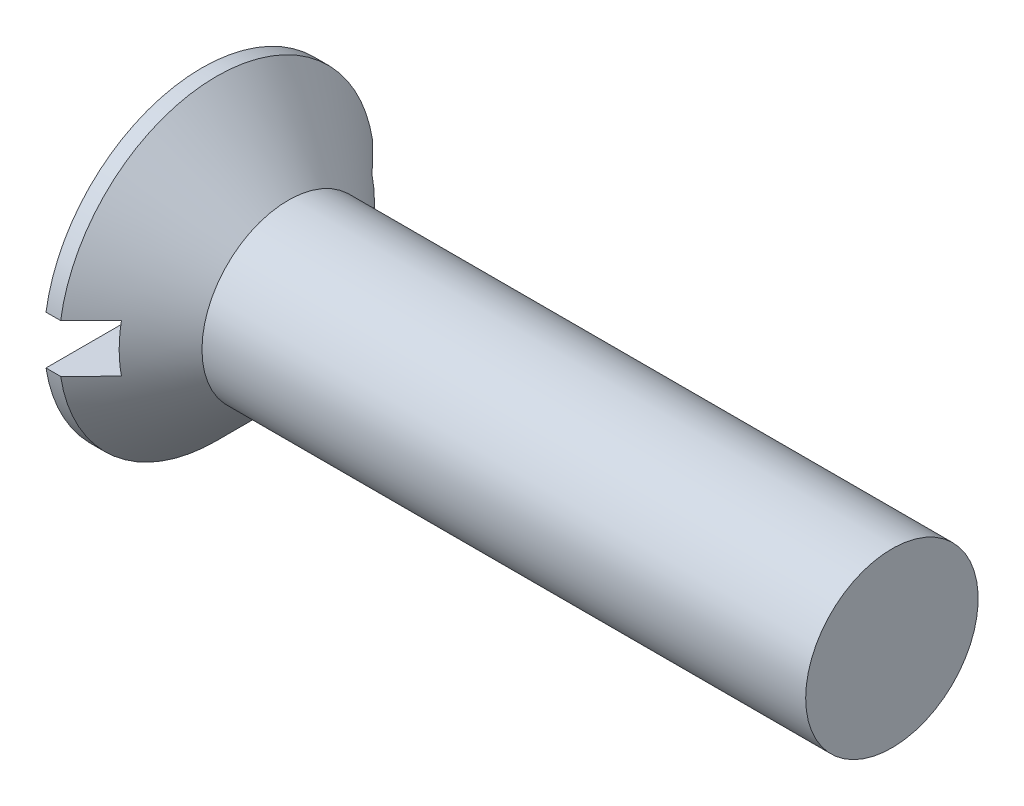
ISO-10303-21;
HEADER;
FILE_DESCRIPTION(('STEP AP214'),'2;1');
FILE_NAME('part.step','',(''),(''),'','','');
FILE_SCHEMA(('AUTOMOTIVE_DESIGN { 1 0 10303 214 1 1 1 1 }'));
ENDSEC;
DATA;
#1=APPLICATION_CONTEXT('core data for automotive mechanical design processes');
#2=APPLICATION_PROTOCOL_DEFINITION('international standard','automotive_design',2000,#1);
#3=PRODUCT_CONTEXT('',#1,'mechanical');
#4=PRODUCT('Part','Part','',(#3));
#5=PRODUCT_RELATED_PRODUCT_CATEGORY('part','',(#4));
#6=PRODUCT_DEFINITION_FORMATION('','',#4);
#7=PRODUCT_DEFINITION_CONTEXT('part definition',#1,'design');
#8=PRODUCT_DEFINITION('design','',#6,#7);
#9=PRODUCT_DEFINITION_SHAPE('','',#8);
#10=(LENGTH_UNIT() NAMED_UNIT(*) SI_UNIT(.MILLI.,.METRE.));
#11=(NAMED_UNIT(*) PLANE_ANGLE_UNIT() SI_UNIT($,.RADIAN.));
#12=(NAMED_UNIT(*) SI_UNIT($,.STERADIAN.) SOLID_ANGLE_UNIT());
#13=UNCERTAINTY_MEASURE_WITH_UNIT(LENGTH_MEASURE(1.E-05),#10,'distance_accuracy_value','');
#14=(GEOMETRIC_REPRESENTATION_CONTEXT(3) GLOBAL_UNCERTAINTY_ASSIGNED_CONTEXT((#13)) GLOBAL_UNIT_ASSIGNED_CONTEXT((#10,
#11,#12)) REPRESENTATION_CONTEXT('',''));
#15=CARTESIAN_POINT('',(0.,0.,0.));
#16=DIRECTION('',(0.,0.,1.));
#17=DIRECTION('',(1.,0.,0.));
#18=AXIS2_PLACEMENT_3D('',#15,#16,#17);
#19=CARTESIAN_POINT('',(2.6,-1.4,-9.15));
#20=DIRECTION('',(1.,0.,0.));
#21=DIRECTION('',(0.,0.,-1.));
#22=AXIS2_PLACEMENT_3D('',#19,#20,#21);
#23=PLANE('',#22);
#24=DIRECTION('',(0.,0.,1.));
#25=VECTOR('',#24,1.);
#26=CARTESIAN_POINT('',(2.6,-0.774782608695622,-9.15));
#27=LINE('',#26,#25);
#28=CARTESIAN_POINT('',(2.6,-0.774782608695655,0.774782608695653));
#29=VERTEX_POINT('',#28);
#30=CARTESIAN_POINT('',(2.6,-0.774782608695663,3.00739130434782));
#31=VERTEX_POINT('',#30);
#32=EDGE_CURVE('E165',#29,#31,#27,.T.);
#33=ORIENTED_EDGE('',*,*,#32,.F.);
#34=DIRECTION('',(0.,1.,0.));
#35=VECTOR('',#34,1.);
#36=CARTESIAN_POINT('',(2.6,-1.4,0.774782608695655));
#37=LINE('',#36,#35);
#38=CARTESIAN_POINT('',(2.6,-1.4,0.774782608695655));
#39=VERTEX_POINT('',#38);
#40=EDGE_CURVE('E11',#39,#29,#37,.T.);
#41=ORIENTED_EDGE('',*,*,#40,.F.);
#42=DIRECTION('',(0.,0.,1.));
#43=VECTOR('',#42,1.);
#44=CARTESIAN_POINT('',(2.6,-1.4,-9.15));
#45=LINE('',#44,#43);
#46=CARTESIAN_POINT('',(2.6,-1.4,7.26636084983399));
#47=VERTEX_POINT('',#46);
#48=EDGE_CURVE('E231',#39,#47,#45,.T.);
#49=ORIENTED_EDGE('',*,*,#48,.T.);
#50=CARTESIAN_POINT('',(2.6,0.,0.));
#51=DIRECTION('',(1.,0.,0.));
#52=DIRECTION('',(0.,0.,-1.));
#53=AXIS2_PLACEMENT_3D('',#50,#51,#52);
#54=CIRCLE('',#53,7.40000000000001);
#55=CARTESIAN_POINT('',(2.6,1.4,7.26636084983399));
#56=VERTEX_POINT('',#55);
#57=EDGE_CURVE('E267',#47,#56,#54,.F.);
#58=ORIENTED_EDGE('',*,*,#57,.T.);
#59=DIRECTION('',(0.,0.,-1.));
#60=VECTOR('',#59,1.);
#61=CARTESIAN_POINT('',(2.6,1.4,9.15));
#62=LINE('',#61,#60);
#63=CARTESIAN_POINT('',(2.6,1.4,0.774782608695654));
#64=VERTEX_POINT('',#63);
#65=EDGE_CURVE('E228',#56,#64,#62,.T.);
#66=ORIENTED_EDGE('',*,*,#65,.T.);
#67=CARTESIAN_POINT('',(2.6,0.774782608695649,0.774782608695653));
#68=VERTEX_POINT('',#67);
#69=EDGE_CURVE('E42',#68,#64,#37,.T.);
#70=ORIENTED_EDGE('',*,*,#69,.F.);
#71=DIRECTION('',(0.,0.,-1.));
#72=VECTOR('',#71,1.);
#73=CARTESIAN_POINT('',(2.6,0.774782608695683,-9.14999999999999));
#74=LINE('',#73,#72);
#75=CARTESIAN_POINT('',(2.6,0.774782608695642,3.00739130434783));
#76=VERTEX_POINT('',#75);
#77=EDGE_CURVE('E373',#76,#68,#74,.T.);
#78=ORIENTED_EDGE('',*,*,#77,.F.);
#79=DIRECTION('',(0.,1.,0.));
#80=VECTOR('',#79,1.);
#81=CARTESIAN_POINT('',(2.6,-1.40000000000004,3.00739130434782));
#82=LINE('',#81,#80);
#83=EDGE_CURVE('E317',#31,#76,#82,.T.);
#84=ORIENTED_EDGE('',*,*,#83,.F.);
#85=EDGE_LOOP('',(#33,#41,#49,#58,#66,#70,#78,#84));
#86=FACE_BOUND('',#85,.T.);
#87=ADVANCED_FACE('F34',(#86),#23,.F.);
#88=DIRECTION('',(0.,0.,1.));
#89=VECTOR('',#88,1.);
#90=CARTESIAN_POINT('',(2.6,-0.774782608695622,-9.15));
#91=LINE('',#90,#89);
#92=CARTESIAN_POINT('',(2.6,-0.774782608695642,-3.00739130434783));
#93=VERTEX_POINT('',#92);
#94=CARTESIAN_POINT('',(2.6,-0.77478260869565,-0.774782608695652));
#95=VERTEX_POINT('',#94);
#96=EDGE_CURVE('E190',#93,#95,#91,.T.);
#97=ORIENTED_EDGE('',*,*,#96,.F.);
#98=DIRECTION('',(0.,-1.,0.));
#99=VECTOR('',#98,1.);
#100=CARTESIAN_POINT('',(2.6,-1.40000000000002,-3.00739130434783));
#101=LINE('',#100,#99);
#102=CARTESIAN_POINT('',(2.6,0.774782608695662,-3.00739130434782));
#103=VERTEX_POINT('',#102);
#104=EDGE_CURVE('E367',#103,#93,#101,.T.);
#105=ORIENTED_EDGE('',*,*,#104,.F.);
#106=DIRECTION('',(0.,0.,-1.));
#107=VECTOR('',#106,1.);
#108=CARTESIAN_POINT('',(2.6,0.774782608695683,-9.14999999999999));
#109=LINE('',#108,#107);
#110=CARTESIAN_POINT('',(2.6,0.774782608695654,-0.774782608695652));
#111=VERTEX_POINT('',#110);
#112=EDGE_CURVE('E378',#111,#103,#109,.T.);
#113=ORIENTED_EDGE('',*,*,#112,.F.);
#114=DIRECTION('',(0.,-1.,0.));
#115=VECTOR('',#114,1.);
#116=CARTESIAN_POINT('',(2.6,-1.4,-0.774782608695653));
#117=LINE('',#116,#115);
#118=CARTESIAN_POINT('',(2.6,1.4,-0.774782608695653));
#119=VERTEX_POINT('',#118);
#120=EDGE_CURVE('E348',#119,#111,#117,.T.);
#121=ORIENTED_EDGE('',*,*,#120,.F.);
#122=CARTESIAN_POINT('',(2.6,1.4,-7.26636084983399));
#123=VERTEX_POINT('',#122);
#124=EDGE_CURVE('E56',#119,#123,#62,.T.);
#125=ORIENTED_EDGE('',*,*,#124,.T.);
#126=CARTESIAN_POINT('',(2.6,-1.4,-7.26636084983399));
#127=VERTEX_POINT('',#126);
#128=EDGE_CURVE('E264',#123,#127,#54,.F.);
#129=ORIENTED_EDGE('',*,*,#128,.T.);
#130=CARTESIAN_POINT('',(2.6,-1.4,-0.774782608695653));
#131=VERTEX_POINT('',#130);
#132=EDGE_CURVE('E232',#127,#131,#45,.T.);
#133=ORIENTED_EDGE('',*,*,#132,.T.);
#134=EDGE_CURVE('E347',#95,#131,#117,.T.);
#135=ORIENTED_EDGE('',*,*,#134,.F.);
#136=EDGE_LOOP('',(#97,#105,#113,#121,#125,#129,#133,#135));
#137=FACE_BOUND('',#136,.T.);
#138=ADVANCED_FACE('F310',(#137),#23,.F.);
#139=CARTESIAN_POINT('',(6.6459392575928,0.,0.439876265466817));
#140=DIRECTION('',(-0.0824937845566324,0.,-0.996591579088206));
#141=DIRECTION('',(-0.996591579088206,0.,0.0824937845566324));
#142=AXIS2_PLACEMENT_3D('',#139,#140,#141);
#143=PLANE('',#142);
#144=ORIENTED_EDGE('',*,*,#40,.T.);
#145=DIRECTION('',(0.993217774269884,0.0822145147597983,-0.0822145147597981));
#146=VECTOR('',#145,1.);
#147=CARTESIAN_POINT('',(6.68185819745171,-0.436903042184183,0.436903042184182));
#148=LINE('',#147,#146);
#149=CARTESIAN_POINT('',(5.98,-0.495000000000002,0.494999999999998));
#150=VERTEX_POINT('',#149);
#151=EDGE_CURVE('E163',#29,#150,#148,.T.);
#152=ORIENTED_EDGE('',*,*,#151,.T.);
#153=DIRECTION('',(0.800804244667336,0.595246633368948,-0.0662873078779819));
#154=VECTOR('',#153,1.);
#155=CARTESIAN_POINT('',(0.,-4.94,0.990000000000001));
#156=LINE('',#155,#154);
#157=CARTESIAN_POINT('',(0.,-4.94,0.990000000000001));
#158=VERTEX_POINT('',#157);
#159=EDGE_CURVE('E187',#158,#150,#156,.T.);
#160=ORIENTED_EDGE('',*,*,#159,.F.);
#161=DIRECTION('',(0.,-1.,0.));
#162=VECTOR('',#161,1.);
#163=CARTESIAN_POINT('',(0.,4.94,0.989999999999999));
#164=LINE('',#163,#162);
#165=CARTESIAN_POINT('',(0.,-1.4,0.99));
#166=VERTEX_POINT('',#165);
#167=EDGE_CURVE('E324',#166,#158,#164,.T.);
#168=ORIENTED_EDGE('',*,*,#167,.F.);
#169=DIRECTION('',(0.996591579088206,0.,-0.0824937845566324));
#170=VECTOR('',#169,1.);
#171=CARTESIAN_POINT('',(3.4159422920296,-1.4,0.707242235024309));
#172=LINE('',#171,#170);
#173=EDGE_CURVE('E223',#166,#39,#172,.T.);
#174=ORIENTED_EDGE('',*,*,#173,.T.);
#175=EDGE_LOOP('',(#144,#152,#160,#168,#174));
#176=FACE_BOUND('',#175,.T.);
#177=ADVANCED_FACE('F185',(#176),#143,.T.);
#178=DIRECTION('',(0.800804244667336,-0.595246633368948,-0.0662873078779817));
#179=VECTOR('',#178,1.);
#180=CARTESIAN_POINT('',(0.,4.94,0.989999999999999));
#181=LINE('',#180,#179);
#182=CARTESIAN_POINT('',(0.,4.94,0.989999999999999));
#183=VERTEX_POINT('',#182);
#184=CARTESIAN_POINT('',(5.98,0.495,0.495));
#185=VERTEX_POINT('',#184);
#186=EDGE_CURVE('E210',#183,#185,#181,.T.);
#187=ORIENTED_EDGE('',*,*,#186,.T.);
#188=DIRECTION('',(-0.993217774269884,0.0822145147597977,0.082214514759798));
#189=VECTOR('',#188,1.);
#190=CARTESIAN_POINT('',(6.68185819745171,0.43690304218418,0.436903042184181));
#191=LINE('',#190,#189);
#192=EDGE_CURVE('E375',#185,#68,#191,.T.);
#193=ORIENTED_EDGE('',*,*,#192,.T.);
#194=ORIENTED_EDGE('',*,*,#69,.T.);
#195=DIRECTION('',(-0.996591579088206,0.,0.0824937845566324));
#196=VECTOR('',#195,1.);
#197=CARTESIAN_POINT('',(1.91145151043211,1.4,0.831777843200017));
#198=LINE('',#197,#196);
#199=CARTESIAN_POINT('',(0.,1.4,0.99));
#200=VERTEX_POINT('',#199);
#201=EDGE_CURVE('E225',#64,#200,#198,.T.);
#202=ORIENTED_EDGE('',*,*,#201,.T.);
#203=EDGE_CURVE('E325',#183,#200,#164,.T.);
#204=ORIENTED_EDGE('',*,*,#203,.F.);
#205=EDGE_LOOP('',(#187,#193,#194,#202,#204));
#206=FACE_BOUND('',#205,.T.);
#207=ADVANCED_FACE('F411',(#206),#143,.T.);
#208=CARTESIAN_POINT('',(6.6459392575928,0.,-0.439876265466817));
#209=DIRECTION('',(-0.0824937845566324,0.,0.996591579088206));
#210=DIRECTION('',(0.996591579088206,0.,0.0824937845566324));
#211=AXIS2_PLACEMENT_3D('',#208,#209,#210);
#212=PLANE('',#211);
#213=DIRECTION('',(0.800804244667336,0.595246633368948,0.0662873078779818));
#214=VECTOR('',#213,1.);
#215=CARTESIAN_POINT('',(0.,-4.94,-0.99));
#216=LINE('',#215,#214);
#217=CARTESIAN_POINT('',(0.,-4.94,-0.99));
#218=VERTEX_POINT('',#217);
#219=CARTESIAN_POINT('',(5.98,-0.495,-0.495));
#220=VERTEX_POINT('',#219);
#221=EDGE_CURVE('E205',#218,#220,#216,.T.);
#222=ORIENTED_EDGE('',*,*,#221,.T.);
#223=DIRECTION('',(-0.993217774269884,-0.0822145147597978,-0.082214514759798));
#224=VECTOR('',#223,1.);
#225=CARTESIAN_POINT('',(6.68185819745171,-0.43690304218418,-0.436903042184181));
#226=LINE('',#225,#224);
#227=EDGE_CURVE('E364',#220,#95,#226,.T.);
#228=ORIENTED_EDGE('',*,*,#227,.T.);
#229=ORIENTED_EDGE('',*,*,#134,.T.);
#230=DIRECTION('',(-0.996591579088206,0.,-0.0824937845566324));
#231=VECTOR('',#230,1.);
#232=CARTESIAN_POINT('',(1.91145151043211,-1.4,-0.831777843200017));
#233=LINE('',#232,#231);
#234=CARTESIAN_POINT('',(0.,-1.4,-0.99));
#235=VERTEX_POINT('',#234);
#236=EDGE_CURVE('E220',#131,#235,#233,.T.);
#237=ORIENTED_EDGE('',*,*,#236,.T.);
#238=DIRECTION('',(0.,1.,0.));
#239=VECTOR('',#238,1.);
#240=CARTESIAN_POINT('',(0.,-4.94,-0.99));
#241=LINE('',#240,#239);
#242=EDGE_CURVE('E208',#218,#235,#241,.T.);
#243=ORIENTED_EDGE('',*,*,#242,.F.);
#244=EDGE_LOOP('',(#222,#228,#229,#237,#243));
#245=FACE_BOUND('',#244,.T.);
#246=ADVANCED_FACE('F361',(#245),#212,.T.);
#247=ORIENTED_EDGE('',*,*,#120,.T.);
#248=DIRECTION('',(0.993217774269884,-0.0822145147597983,0.082214514759798));
#249=VECTOR('',#248,1.);
#250=CARTESIAN_POINT('',(6.68185819745171,0.436903042184183,-0.436903042184181));
#251=LINE('',#250,#249);
#252=CARTESIAN_POINT('',(5.98,0.495000000000002,-0.494999999999998));
#253=VERTEX_POINT('',#252);
#254=EDGE_CURVE('E380',#111,#253,#251,.T.);
#255=ORIENTED_EDGE('',*,*,#254,.T.);
#256=DIRECTION('',(0.800804244667336,-0.595246633368948,0.0662873078779818));
#257=VECTOR('',#256,1.);
#258=CARTESIAN_POINT('',(0.,4.94,-0.99));
#259=LINE('',#258,#257);
#260=CARTESIAN_POINT('',(0.,4.94,-0.99));
#261=VERTEX_POINT('',#260);
#262=EDGE_CURVE('E199',#261,#253,#259,.T.);
#263=ORIENTED_EDGE('',*,*,#262,.F.);
#264=CARTESIAN_POINT('',(0.,1.4,-0.99));
#265=VERTEX_POINT('',#264);
#266=EDGE_CURVE('E204',#265,#261,#241,.T.);
#267=ORIENTED_EDGE('',*,*,#266,.F.);
#268=DIRECTION('',(0.996591579088206,0.,0.0824937845566324));
#269=VECTOR('',#268,1.);
#270=CARTESIAN_POINT('',(3.4159422920296,1.4,-0.707242235024309));
#271=LINE('',#270,#269);
#272=EDGE_CURVE('E49',#265,#119,#271,.T.);
#273=ORIENTED_EDGE('',*,*,#272,.T.);
#274=EDGE_LOOP('',(#247,#255,#263,#267,#273));
#275=FACE_BOUND('',#274,.T.);
#276=ADVANCED_FACE('F414',(#275),#212,.T.);
#277=CARTESIAN_POINT('',(0.,0.,0.));
#278=DIRECTION('',(-1.,0.,0.));
#279=DIRECTION('',(0.,0.,1.));
#280=AXIS2_PLACEMENT_3D('',#277,#278,#279);
#281=PLANE('',#280);
#282=DIRECTION('',(0.,0.,1.));
#283=VECTOR('',#282,1.);
#284=CARTESIAN_POINT('',(0.,4.94,-0.99));
#285=LINE('',#284,#283);
#286=EDGE_CURVE('E321',#261,#183,#285,.T.);
#287=ORIENTED_EDGE('',*,*,#286,.T.);
#288=ORIENTED_EDGE('',*,*,#203,.T.);
#289=DIRECTION('',(0.,0.,-1.));
#290=VECTOR('',#289,1.);
#291=CARTESIAN_POINT('',(0.,1.4,9.15));
#292=LINE('',#291,#290);
#293=CARTESIAN_POINT('',(0.,1.4,9.0422618851701));
#294=VERTEX_POINT('',#293);
#295=EDGE_CURVE('E236',#294,#200,#292,.T.);
#296=ORIENTED_EDGE('',*,*,#295,.F.);
#297=CARTESIAN_POINT('',(0.,0.,0.));
#298=DIRECTION('',(-1.,0.,0.));
#299=DIRECTION('',(0.,0.,1.));
#300=AXIS2_PLACEMENT_3D('',#297,#298,#299);
#301=CIRCLE('',#300,9.15);
#302=CARTESIAN_POINT('',(0.,1.4,-9.0422618851701));
#303=VERTEX_POINT('',#302);
#304=EDGE_CURVE('E263',#294,#303,#301,.T.);
#305=ORIENTED_EDGE('',*,*,#304,.T.);
#306=EDGE_CURVE('E227',#265,#303,#292,.T.);
#307=ORIENTED_EDGE('',*,*,#306,.F.);
#308=ORIENTED_EDGE('',*,*,#266,.T.);
#309=EDGE_LOOP('',(#287,#288,#296,#305,#307,#308));
#310=FACE_BOUND('',#309,.T.);
#311=ADVANCED_FACE('F36',(#310),#281,.T.);
#312=DIRECTION('',(0.,0.,1.));
#313=VECTOR('',#312,1.);
#314=CARTESIAN_POINT('',(0.,-1.4,-9.15));
#315=LINE('',#314,#313);
#316=CARTESIAN_POINT('',(0.,-1.4,9.0422618851701));
#317=VERTEX_POINT('',#316);
#318=EDGE_CURVE('E239',#166,#317,#315,.T.);
#319=ORIENTED_EDGE('',*,*,#318,.F.);
#320=ORIENTED_EDGE('',*,*,#167,.T.);
#321=DIRECTION('',(0.,0.,-1.));
#322=VECTOR('',#321,1.);
#323=CARTESIAN_POINT('',(0.,-4.94,0.990000000000001));
#324=LINE('',#323,#322);
#325=EDGE_CURVE('E203',#158,#218,#324,.T.);
#326=ORIENTED_EDGE('',*,*,#325,.T.);
#327=ORIENTED_EDGE('',*,*,#242,.T.);
#328=CARTESIAN_POINT('',(0.,-1.4,-9.0422618851701));
#329=VERTEX_POINT('',#328);
#330=EDGE_CURVE('E240',#329,#235,#315,.T.);
#331=ORIENTED_EDGE('',*,*,#330,.F.);
#332=EDGE_CURVE('E260',#329,#317,#301,.T.);
#333=ORIENTED_EDGE('',*,*,#332,.T.);
#334=EDGE_LOOP('',(#319,#320,#326,#327,#331,#333));
#335=FACE_BOUND('',#334,.T.);
#336=ADVANCED_FACE('F295',(#335),#281,.T.);
#337=CARTESIAN_POINT('',(2.6,1.4,9.15));
#338=DIRECTION('',(0.,1.,0.));
#339=DIRECTION('',(0.,0.,1.));
#340=AXIS2_PLACEMENT_3D('',#337,#338,#339);
#341=PLANE('',#340);
#342=ORIENTED_EDGE('',*,*,#201,.F.);
#343=ORIENTED_EDGE('',*,*,#65,.F.);
#344=CARTESIAN_POINT('',(-10.1802906614588,1.4,-20.1316698557512));
#345=CARTESIAN_POINT('',(-9.48488043298228,1.4,-19.4345666201556));
#346=CARTESIAN_POINT('',(-8.78954455363777,1.4,-18.7373891609851));
#347=CARTESIAN_POINT('',(-7.39910043445031,1.4,-17.3427719540358));
#348=CARTESIAN_POINT('',(-6.70399220084266,1.4,-16.6453322000407));
#349=CARTESIAN_POINT('',(-5.31371206148003,1.4,-15.2497048155075));
#350=CARTESIAN_POINT('',(-4.6185403553646,1.4,-14.5515169860536));
#351=CARTESIAN_POINT('',(-3.22873871546778,1.4,-13.1546366924144));
#352=CARTESIAN_POINT('',(-2.53410876869493,1.4,-12.4559442411553));
#353=CARTESIAN_POINT('',(-1.14548224055076,1.4,-11.0575206345502));
#354=CARTESIAN_POINT('',(-0.451485906136947,1.4,-10.3577892337916));
#355=CARTESIAN_POINT('',(0.588390603329139,1.4,-9.30703247995864));
#356=CARTESIAN_POINT('',(0.934843002413313,1.4,-8.95657352849666));
#357=CARTESIAN_POINT('',(1.62719938835855,1.4,-8.2551191709717));
#358=CARTESIAN_POINT('',(1.97310337925641,1.4,-7.90412376889521));
#359=CARTESIAN_POINT('',(2.66398514694666,1.4,-7.20147284141355));
#360=CARTESIAN_POINT('',(3.00896321428025,1.4,-6.84981760175461));
#361=CARTESIAN_POINT('',(3.69769802945329,1.4,-6.14529129721105));
#362=CARTESIAN_POINT('',(4.04145474223793,1.4,-5.79242019799284));
#363=CARTESIAN_POINT('',(4.55549337314532,1.4,-5.26161172777983));
#364=CARTESIAN_POINT('',(4.72656238682918,1.4,-5.08443689111279));
#365=CARTESIAN_POINT('',(5.06798185988705,1.4,-4.72939656642209));
#366=CARTESIAN_POINT('',(5.23833232155516,1.4,-4.55153108060692));
#367=CARTESIAN_POINT('',(5.57802572591668,1.4,-4.19485557401774));
#368=CARTESIAN_POINT('',(5.7473687145206,1.4,-4.01604559699614));
#369=CARTESIAN_POINT('',(6.08460595089404,1.4,-3.65706575802822));
#370=CARTESIAN_POINT('',(6.25250022470158,1.4,-3.47689592063249));
#371=CARTESIAN_POINT('',(6.46471077647202,1.4,-3.24632629007188));
#372=CARTESIAN_POINT('',(6.51006483972923,1.4,-3.19688150609182));
#373=CARTESIAN_POINT('',(6.60058022361491,1.4,-3.09781558301871));
#374=CARTESIAN_POINT('',(6.64574154363798,1.4,-3.04819444337264));
#375=CARTESIAN_POINT('',(6.78090070161663,1.4,-2.89903015221317));
#376=CARTESIAN_POINT('',(6.87057083906247,1.4,-2.79918927121578));
#377=CARTESIAN_POINT('',(7.04886062729584,1.4,-2.59833920956725));
#378=CARTESIAN_POINT('',(7.13747875576387,1.4,-2.49732867521849));
#379=CARTESIAN_POINT('',(7.31309984074697,1.4,-2.29392146631554));
#380=CARTESIAN_POINT('',(7.40010292731351,1.4,-2.19152490452969));
#381=CARTESIAN_POINT('',(7.55767384917085,1.4,-2.00181576169137));
#382=CARTESIAN_POINT('',(7.62859032868367,1.4,-1.91479370288945));
#383=CARTESIAN_POINT('',(7.76816100241459,1.4,-1.73895756265594));
#384=CARTESIAN_POINT('',(7.83681542973158,1.4,-1.65014366739901));
#385=CARTESIAN_POINT('',(7.97081438730525,1.4,-1.47010756313905));
#386=CARTESIAN_POINT('',(8.03616068050879,1.4,-1.37888667713564));
#387=CARTESIAN_POINT('',(8.16185481795934,1.4,-1.19309429595569));
#388=CARTESIAN_POINT('',(8.22220597308291,1.4,-1.0985250804488));
#389=CARTESIAN_POINT('',(8.33132072434372,1.4,-0.911003142488491));
#390=CARTESIAN_POINT('',(8.38058324145228,1.4,-0.818346947978579));
#391=CARTESIAN_POINT('',(8.4679772203323,1.4,-0.62787959546742));
#392=CARTESIAN_POINT('',(8.50612811789059,1.4,-0.530077796075779));
#393=CARTESIAN_POINT('',(8.55923073108678,1.4,-0.348849904330401));
#394=CARTESIAN_POINT('',(8.57726952854541,1.4,-0.266379839912257));
#395=CARTESIAN_POINT('',(8.59349195610696,1.4,-0.141377361201956));
#396=CARTESIAN_POINT('',(8.59709473917006,1.4,-0.0995235945665665));
#397=CARTESIAN_POINT('',(8.60053735444463,1.4,-0.0156540201724839));
#398=CARTESIAN_POINT('',(8.60037724406726,1.4,0.0263617851041769));
#399=CARTESIAN_POINT('',(8.59629462216206,1.4,0.110198182835154));
#400=CARTESIAN_POINT('',(8.59237279776442,1.4,0.152018809539687));
#401=CARTESIAN_POINT('',(8.5809825684757,1.4,0.235176084548624));
#402=CARTESIAN_POINT('',(8.57351339899295,1.4,0.276512626544739));
#403=CARTESIAN_POINT('',(8.55537007077989,1.4,0.358554412928613));
#404=CARTESIAN_POINT('',(8.54468949866927,1.4,0.399258221020585));
#405=CARTESIAN_POINT('',(8.5205557967028,1.4,0.479823786953263));
#406=CARTESIAN_POINT('',(8.50710265311226,1.4,0.519685540621547));
#407=CARTESIAN_POINT('',(8.45598857372599,1.4,0.657534606153095));
#408=CARTESIAN_POINT('',(8.41222351574168,1.4,0.753257424528381));
#409=CARTESIAN_POINT('',(8.31559263367326,1.4,0.940019642134538));
#410=CARTESIAN_POINT('',(8.26270605903273,1.4,1.03104773415757));
#411=CARTESIAN_POINT('',(8.15070766112158,1.4,1.21029142661936));
#412=CARTESIAN_POINT('',(8.09154412067923,1.4,1.2984743635146));
#413=CARTESIAN_POINT('',(7.99997236203098,1.4,1.42865262234275));
#414=CARTESIAN_POINT('',(7.96899427298008,1.4,1.47167410830265));
#415=CARTESIAN_POINT('',(7.90624286041765,1.4,1.55713237389056));
#416=CARTESIAN_POINT('',(7.87446956446809,1.4,1.59956917370505));
#417=CARTESIAN_POINT('',(7.77069466033925,1.4,1.73595964112493));
#418=CARTESIAN_POINT('',(7.69739242049313,1.4,1.82892258419788));
#419=CARTESIAN_POINT('',(7.54857227415178,1.4,2.01306279893539));
#420=CARTESIAN_POINT('',(7.47305407473414,1.4,2.10423983184423));
#421=CARTESIAN_POINT('',(7.32040938866978,1.4,2.28529575942909));
#422=CARTESIAN_POINT('',(7.24328228035727,1.4,2.37517412872904));
#423=CARTESIAN_POINT('',(7.0878605764758,1.4,2.55391719822478));
#424=CARTESIAN_POINT('',(7.00956594745415,1.4,2.64278186924606));
#425=CARTESIAN_POINT('',(6.7731341321893,1.4,2.90848075734406));
#426=CARTESIAN_POINT('',(6.61368386678828,1.4,3.08414520481737));
#427=CARTESIAN_POINT('',(6.2927022190868,1.4,3.43347386961335));
#428=CARTESIAN_POINT('',(6.13117133971699,1.4,3.60713855179007));
#429=CARTESIAN_POINT('',(5.80761409964983,1.4,3.95217228611247));
#430=CARTESIAN_POINT('',(5.64559564213671,1.4,4.12354875708039));
#431=CARTESIAN_POINT('',(5.32058360592324,1.4,4.46539281787538));
#432=CARTESIAN_POINT('',(5.1575899686771,1.4,4.63586035194776));
#433=CARTESIAN_POINT('',(4.83104912339113,1.4,4.97597335628547));
#434=CARTESIAN_POINT('',(4.66750253492793,1.4,5.14561942180073));
#435=CARTESIAN_POINT('',(4.33989126297806,1.4,5.48440367859122));
#436=CARTESIAN_POINT('',(4.17582658989263,1.4,5.65354187993118));
#437=CARTESIAN_POINT('',(3.71981430769449,1.4,6.12255600621086));
#438=CARTESIAN_POINT('',(3.4274406203696,1.4,6.42201756281031));
#439=CARTESIAN_POINT('',(2.84187679686423,1.4,7.02014164576414));
#440=CARTESIAN_POINT('',(2.5486866590775,1.4,7.31880417054427));
#441=CARTESIAN_POINT('',(1.66827583502464,1.4,8.21397933499673));
#442=CARTESIAN_POINT('',(1.0802219070279,1.4,8.80967222109664));
#443=CARTESIAN_POINT('',(-0.0972987867163045,1.4,10.0001447069985));
#444=CARTESIAN_POINT('',(-0.686766035285578,1.4,10.5949238285768));
#445=CARTESIAN_POINT('',(-1.86641300136396,1.4,11.7837688200009));
#446=CARTESIAN_POINT('',(-2.45659271507678,1.4,12.3778346936138));
#447=CARTESIAN_POINT('',(-3.64096240809459,1.4,13.5690800205838));
#448=CARTESIAN_POINT('',(-4.2351551612671,1.4,14.1662567151544));
#449=CARTESIAN_POINT('',(-5.42386028814457,1.4,15.3602940049768));
#450=CARTESIAN_POINT('',(-6.01837266241674,1.4,15.9571545996639));
#451=CARTESIAN_POINT('',(-7.20735875067841,1.4,17.1503857488358));
#452=CARTESIAN_POINT('',(-7.8018323644246,1.4,17.7467564032186));
#453=CARTESIAN_POINT('',(-8.99094844027763,1.4,18.9393270528177));
#454=CARTESIAN_POINT('',(-9.58559090205492,1.4,19.5355270483625));
#455=CARTESIAN_POINT('',(-10.1802906614588,1.4,20.1316698557512));
#456=B_SPLINE_CURVE_WITH_KNOTS('',3,(#344,#345,#346,#347,#348,#349,#350,#351,#352,#353,#354,
#355,#356,#357,#358,#359,#360,#361,#362,#363,#364,#365,#366,#367,#368,#369,#370,#371,#372,#373,
#374,#375,#376,#377,#378,#379,#380,#381,#382,#383,#384,#385,#386,#387,#388,#389,#390,#391,#392,
#393,#394,#395,#396,#397,#398,#399,#400,#401,#402,#403,#404,#405,#406,#407,#408,#409,#410,#411,
#412,#413,#414,#415,#416,#417,#418,#419,#420,#421,#422,#423,#424,#425,#426,#427,#428,#429,#430,
#431,#432,#433,#434,#435,#436,#437,#438,#439,#440,#441,#442,#443,#444,#445,#446,#447,#448,#449,
#450,#451,#452,#453,#454,#455),.UNSPECIFIED.,.F.,.F.,(4,2,2,2,2,2,2,2,2,2,2,2,2,2,2,2,2,2,2,2,2,
2,2,2,2,2,2,2,2,2,2,2,2,2,2,2,2,2,2,2,2,2,2,2,2,2,2,2,2,2,2,2,2,2,2,4),(0.,2.95396937304096,
5.90801382908348,8.86378247261382,11.8194779117793,14.7760443304786,16.2544406203997,
17.7328259769105,19.2106748877432,20.6885658779588,21.4274148433696,22.1662614480938,
22.905074121667,23.6438734886506,23.8451589043427,24.0464449517988,24.4490298720391,
24.8521397656342,25.2552170566942,25.5919673290452,25.9286827908871,26.2652168819381,
26.6015260947749,26.9159109045623,27.2297424623561,27.4818473788177,27.6077225152511,
27.7335957311856,27.8594459589776,27.9853233247371,28.1114537645865,28.2375848292719,
28.552426709072,28.8679945051514,29.1864008404014,29.3454380749671,29.5044698048941,
29.8595721598892,30.2147216683739,30.5700110424212,30.9253106161226,31.6369936262996,
32.348507720191,33.0560179588863,33.7635711085621,34.4704963890892,35.1774075662441,
36.43296697936,37.6885288643546,40.1996834223125,42.7118740678154,45.224051386001,
47.7513354207122,50.2786239554754,52.8047892968122,55.3309497410762),.UNSPECIFIED.);
#457=CARTESIAN_POINT('',(0.850000000000015,1.4,9.0422618851701));
#458=VERTEX_POINT('',#457);
#459=EDGE_CURVE('E341',#56,#458,#456,.T.);
#460=ORIENTED_EDGE('',*,*,#459,.T.);
#461=DIRECTION('',(-1.,0.,0.));
#462=VECTOR('',#461,1.);
#463=CARTESIAN_POINT('',(-6.34999999999999,1.4,9.0422618851701));
#464=LINE('',#463,#462);
#465=EDGE_CURVE('E246',#458,#294,#464,.T.);
#466=ORIENTED_EDGE('',*,*,#465,.T.);
#467=ORIENTED_EDGE('',*,*,#295,.T.);
#468=EDGE_LOOP('',(#342,#343,#460,#466,#467));
#469=FACE_BOUND('',#468,.T.);
#470=ADVANCED_FACE('F291',(#469),#341,.F.);
#471=ORIENTED_EDGE('',*,*,#272,.F.);
#472=ORIENTED_EDGE('',*,*,#306,.T.);
#473=DIRECTION('',(-1.,0.,0.));
#474=VECTOR('',#473,1.);
#475=CARTESIAN_POINT('',(-6.34999999999999,1.4,-9.0422618851701));
#476=LINE('',#475,#474);
#477=CARTESIAN_POINT('',(0.850000000000014,1.4,-9.0422618851701));
#478=VERTEX_POINT('',#477);
#479=EDGE_CURVE('E248',#303,#478,#476,.F.);
#480=ORIENTED_EDGE('',*,*,#479,.T.);
#481=EDGE_CURVE('E274',#478,#123,#456,.T.);
#482=ORIENTED_EDGE('',*,*,#481,.T.);
#483=ORIENTED_EDGE('',*,*,#124,.F.);
#484=EDGE_LOOP('',(#471,#472,#480,#482,#483));
#485=FACE_BOUND('',#484,.T.);
#486=ADVANCED_FACE('F288',(#485),#341,.F.);
#487=CARTESIAN_POINT('',(2.6,-1.4,-9.15));
#488=DIRECTION('',(0.,-1.,0.));
#489=DIRECTION('',(0.,0.,-1.));
#490=AXIS2_PLACEMENT_3D('',#487,#488,#489);
#491=PLANE('',#490);
#492=ORIENTED_EDGE('',*,*,#173,.F.);
#493=ORIENTED_EDGE('',*,*,#318,.T.);
#494=DIRECTION('',(-1.,0.,0.));
#495=VECTOR('',#494,1.);
#496=CARTESIAN_POINT('',(-6.34999999999999,-1.4,9.0422618851701));
#497=LINE('',#496,#495);
#498=CARTESIAN_POINT('',(0.850000000000014,-1.4,9.0422618851701));
#499=VERTEX_POINT('',#498);
#500=EDGE_CURVE('E244',#317,#499,#497,.F.);
#501=ORIENTED_EDGE('',*,*,#500,.T.);
#502=CARTESIAN_POINT('',(-10.1802906614588,-1.4,20.1316698557512));
#503=CARTESIAN_POINT('',(-9.48488043298228,-1.4,19.4345666201556));
#504=CARTESIAN_POINT('',(-8.78954455363777,-1.4,18.7373891609851));
#505=CARTESIAN_POINT('',(-7.39910043445032,-1.4,17.3427719540358));
#506=CARTESIAN_POINT('',(-6.70399220084267,-1.4,16.6453322000407));
#507=CARTESIAN_POINT('',(-5.31371206148004,-1.4,15.2497048155075));
#508=CARTESIAN_POINT('',(-4.61854035536461,-1.4,14.5515169860536));
#509=CARTESIAN_POINT('',(-3.2287387154678,-1.4,13.1546366924144));
#510=CARTESIAN_POINT('',(-2.53410876869495,-1.4,12.4559442411554));
#511=CARTESIAN_POINT('',(-1.14548224055077,-1.4,11.0575206345502));
#512=CARTESIAN_POINT('',(-0.451485906136962,-1.4,10.3577892337916));
#513=CARTESIAN_POINT('',(0.588390603329128,-1.4,9.30703247995865));
#514=CARTESIAN_POINT('',(0.934843002413304,-1.4,8.95657352849668));
#515=CARTESIAN_POINT('',(1.62719938835854,-1.4,8.25511917097171));
#516=CARTESIAN_POINT('',(1.9731033792564,-1.4,7.90412376889522));
#517=CARTESIAN_POINT('',(2.66398514694665,-1.4,7.20147284141356));
#518=CARTESIAN_POINT('',(3.00896321428024,-1.4,6.84981760175462));
#519=CARTESIAN_POINT('',(3.69769802945328,-1.4,6.14529129721106));
#520=CARTESIAN_POINT('',(4.04145474223792,-1.4,5.79242019799284));
#521=CARTESIAN_POINT('',(4.55549337314532,-1.4,5.26161172777983));
#522=CARTESIAN_POINT('',(4.72656238682918,-1.4,5.0844368911128));
#523=CARTESIAN_POINT('',(5.06798185988705,-1.4,4.72939656642209));
#524=CARTESIAN_POINT('',(5.23833232155516,-1.4,4.55153108060693));
#525=CARTESIAN_POINT('',(5.57802572591668,-1.4,4.19485557401774));
#526=CARTESIAN_POINT('',(5.7473687145206,-1.4,4.01604559699614));
#527=CARTESIAN_POINT('',(6.08460595089404,-1.4,3.65706575802822));
#528=CARTESIAN_POINT('',(6.25250022470158,-1.4,3.4768959206325));
#529=CARTESIAN_POINT('',(6.46471077647202,-1.4,3.24632629007188));
#530=CARTESIAN_POINT('',(6.51006483972923,-1.4,3.19688150609182));
#531=CARTESIAN_POINT('',(6.60058022361491,-1.4,3.09781558301871));
#532=CARTESIAN_POINT('',(6.64574154363798,-1.4,3.04819444337264));
#533=CARTESIAN_POINT('',(6.78090070161663,-1.4,2.89903015221317));
#534=CARTESIAN_POINT('',(6.87057083906247,-1.4,2.79918927121578));
#535=CARTESIAN_POINT('',(7.04886062729584,-1.4,2.59833920956725));
#536=CARTESIAN_POINT('',(7.13747875576387,-1.4,2.49732867521849));
#537=CARTESIAN_POINT('',(7.31309984074697,-1.4,2.29392146631554));
#538=CARTESIAN_POINT('',(7.40010292731351,-1.4,2.19152490452969));
#539=CARTESIAN_POINT('',(7.55767384917085,-1.4,2.00181576169137));
#540=CARTESIAN_POINT('',(7.62859032868367,-1.4,1.91479370288945));
#541=CARTESIAN_POINT('',(7.76816100241459,-1.4,1.73895756265595));
#542=CARTESIAN_POINT('',(7.83681542973158,-1.4,1.65014366739901));
#543=CARTESIAN_POINT('',(7.97081438730525,-1.4,1.47010756313905));
#544=CARTESIAN_POINT('',(8.03616068050879,-1.4,1.37888667713565));
#545=CARTESIAN_POINT('',(8.16185481795934,-1.4,1.19309429595569));
#546=CARTESIAN_POINT('',(8.22220597308291,-1.4,1.09852508044881));
#547=CARTESIAN_POINT('',(8.33132072434371,-1.4,0.911003142488495));
#548=CARTESIAN_POINT('',(8.38058324145228,-1.4,0.818346947978583));
#549=CARTESIAN_POINT('',(8.4679772203323,-1.4,0.627879595467423));
#550=CARTESIAN_POINT('',(8.50612811789059,-1.4,0.530077796075782));
#551=CARTESIAN_POINT('',(8.55923073108678,-1.4,0.348849904330404));
#552=CARTESIAN_POINT('',(8.57726952854541,-1.4,0.26637983991226));
#553=CARTESIAN_POINT('',(8.59349195610696,-1.4,0.141377361201958));
#554=CARTESIAN_POINT('',(8.59709473917006,-1.4,0.0995235945665672));
#555=CARTESIAN_POINT('',(8.60053735444462,-1.4,0.0156540201724844));
#556=CARTESIAN_POINT('',(8.60037724406725,-1.4,-0.0263617851041753));
#557=CARTESIAN_POINT('',(8.59629462216206,-1.4,-0.110198182835152));
#558=CARTESIAN_POINT('',(8.59237279776442,-1.4,-0.152018809539685));
#559=CARTESIAN_POINT('',(8.5809825684757,-1.4,-0.235176084548622));
#560=CARTESIAN_POINT('',(8.57351339899295,-1.4,-0.276512626544738));
#561=CARTESIAN_POINT('',(8.55537007077989,-1.4,-0.358554412928613));
#562=CARTESIAN_POINT('',(8.54468949866927,-1.4,-0.399258221020585));
#563=CARTESIAN_POINT('',(8.5205557967028,-1.4,-0.479823786953262));
#564=CARTESIAN_POINT('',(8.50710265311226,-1.4,-0.519685540621545));
#565=CARTESIAN_POINT('',(8.45598857372599,-1.4,-0.657534606153092));
#566=CARTESIAN_POINT('',(8.41222351574169,-1.4,-0.753257424528378));
#567=CARTESIAN_POINT('',(8.31559263367327,-1.4,-0.940019642134534));
#568=CARTESIAN_POINT('',(8.26270605903273,-1.4,-1.03104773415756));
#569=CARTESIAN_POINT('',(8.15070766112158,-1.4,-1.21029142661935));
#570=CARTESIAN_POINT('',(8.09154412067923,-1.4,-1.29847436351459));
#571=CARTESIAN_POINT('',(7.99997236203098,-1.4,-1.42865262234274));
#572=CARTESIAN_POINT('',(7.96899427298008,-1.4,-1.47167410830264));
#573=CARTESIAN_POINT('',(7.90624286041765,-1.4,-1.55713237389056));
#574=CARTESIAN_POINT('',(7.87446956446809,-1.4,-1.59956917370504));
#575=CARTESIAN_POINT('',(7.77069466033926,-1.4,-1.73595964112493));
#576=CARTESIAN_POINT('',(7.69739242049314,-1.4,-1.82892258419787));
#577=CARTESIAN_POINT('',(7.54857227415179,-1.4,-2.01306279893538));
#578=CARTESIAN_POINT('',(7.47305407473415,-1.4,-2.10423983184422));
#579=CARTESIAN_POINT('',(7.32040938866979,-1.4,-2.28529575942908));
#580=CARTESIAN_POINT('',(7.24328228035728,-1.4,-2.37517412872903));
#581=CARTESIAN_POINT('',(7.08786057647581,-1.4,-2.55391719822476));
#582=CARTESIAN_POINT('',(7.00956594745416,-1.4,-2.64278186924605));
#583=CARTESIAN_POINT('',(6.77313413218931,-1.4,-2.90848075734405));
#584=CARTESIAN_POINT('',(6.61368386678829,-1.4,-3.08414520481736));
#585=CARTESIAN_POINT('',(6.29270221908682,-1.4,-3.43347386961333));
#586=CARTESIAN_POINT('',(6.13117133971701,-1.4,-3.60713855179005));
#587=CARTESIAN_POINT('',(5.80761409964984,-1.4,-3.95217228611244));
#588=CARTESIAN_POINT('',(5.64559564213673,-1.4,-4.12354875708037));
#589=CARTESIAN_POINT('',(5.32058360592326,-1.4,-4.46539281787535));
#590=CARTESIAN_POINT('',(5.15758996867712,-1.4,-4.63586035194774));
#591=CARTESIAN_POINT('',(4.83104912339115,-1.4,-4.97597335628545));
#592=CARTESIAN_POINT('',(4.66750253492796,-1.4,-5.1456194218007));
#593=CARTESIAN_POINT('',(4.33989126297809,-1.4,-5.4844036785912));
#594=CARTESIAN_POINT('',(4.17582658989266,-1.4,-5.65354187993116));
#595=CARTESIAN_POINT('',(3.71981430769452,-1.4,-6.12255600621083));
#596=CARTESIAN_POINT('',(3.42744062036962,-1.4,-6.42201756281029));
#597=CARTESIAN_POINT('',(2.84187679686425,-1.4,-7.02014164576411));
#598=CARTESIAN_POINT('',(2.54868665907753,-1.4,-7.31880417054424));
#599=CARTESIAN_POINT('',(1.66827583502467,-1.4,-8.2139793349967));
#600=CARTESIAN_POINT('',(1.08022190702793,-1.4,-8.80967222109661));
#601=CARTESIAN_POINT('',(-0.0972987867162794,-1.4,-10.0001447069985));
#602=CARTESIAN_POINT('',(-0.686766035285555,-1.4,-10.5949238285768));
#603=CARTESIAN_POINT('',(-1.86641300136394,-1.4,-11.7837688200009));
#604=CARTESIAN_POINT('',(-2.45659271507676,-1.4,-12.3778346936138));
#605=CARTESIAN_POINT('',(-3.64096240809457,-1.4,-13.5690800205838));
#606=CARTESIAN_POINT('',(-4.23515516126709,-1.4,-14.1662567151544));
#607=CARTESIAN_POINT('',(-5.42386028814455,-1.4,-15.3602940049768));
#608=CARTESIAN_POINT('',(-6.01837266241673,-1.4,-15.9571545996639));
#609=CARTESIAN_POINT('',(-7.2073587506784,-1.4,-17.1503857488358));
#610=CARTESIAN_POINT('',(-7.80183236442459,-1.4,-17.7467564032186));
#611=CARTESIAN_POINT('',(-8.99094844027763,-1.4,-18.9393270528177));
#612=CARTESIAN_POINT('',(-9.58559090205492,-1.4,-19.5355270483625));
#613=CARTESIAN_POINT('',(-10.1802906614588,-1.4,-20.1316698557512));
#614=B_SPLINE_CURVE_WITH_KNOTS('',3,(#502,#503,#504,#505,#506,#507,#508,#509,#510,#511,#512,
#513,#514,#515,#516,#517,#518,#519,#520,#521,#522,#523,#524,#525,#526,#527,#528,#529,#530,#531,
#532,#533,#534,#535,#536,#537,#538,#539,#540,#541,#542,#543,#544,#545,#546,#547,#548,#549,#550,
#551,#552,#553,#554,#555,#556,#557,#558,#559,#560,#561,#562,#563,#564,#565,#566,#567,#568,#569,
#570,#571,#572,#573,#574,#575,#576,#577,#578,#579,#580,#581,#582,#583,#584,#585,#586,#587,#588,
#589,#590,#591,#592,#593,#594,#595,#596,#597,#598,#599,#600,#601,#602,#603,#604,#605,#606,#607,
#608,#609,#610,#611,#612,#613),.UNSPECIFIED.,.F.,.F.,(4,2,2,2,2,2,2,2,2,2,2,2,2,2,2,2,2,2,2,2,2,
2,2,2,2,2,2,2,2,2,2,2,2,2,2,2,2,2,2,2,2,2,2,2,2,2,2,2,2,2,2,2,2,2,2,4),(0.,2.95396937304095,
5.90801382908346,8.8637824726138,11.8194779117793,14.7760443304786,16.2544406203997,
17.7328259769105,19.2106748877432,20.6885658779588,21.4274148433696,22.1662614480938,
22.905074121667,23.6438734886506,23.8451589043427,24.0464449517988,24.4490298720391,
24.8521397656342,25.2552170566942,25.5919673290452,25.9286827908871,26.2652168819381,
26.6015260947749,26.9159109045623,27.2297424623561,27.4818473788177,27.6077225152511,
27.7335957311856,27.8594459589776,27.9853233247372,28.1114537645865,28.2375848292719,
28.552426709072,28.8679945051515,29.1864008404014,29.3454380749671,29.5044698048941,
29.8595721598892,30.2147216683739,30.5700110424212,30.9253106161226,31.6369936262996,
32.348507720191,33.0560179588863,33.7635711085621,34.4704963890891,35.1774075662441,
36.4329669793599,37.6885288643546,40.1996834223124,42.7118740678153,45.224051386001,
47.7513354207122,50.2786239554754,52.8047892968122,55.3309497410762),.UNSPECIFIED.);
#615=EDGE_CURVE('E275',#499,#47,#614,.T.);
#616=ORIENTED_EDGE('',*,*,#615,.T.);
#617=ORIENTED_EDGE('',*,*,#48,.F.);
#618=EDGE_LOOP('',(#492,#493,#501,#616,#617));
#619=FACE_BOUND('',#618,.T.);
#620=ADVANCED_FACE('F283',(#619),#491,.F.);
#621=ORIENTED_EDGE('',*,*,#236,.F.);
#622=ORIENTED_EDGE('',*,*,#132,.F.);
#623=CARTESIAN_POINT('',(0.850000000000015,-1.4,-9.0422618851701));
#624=VERTEX_POINT('',#623);
#625=EDGE_CURVE('E266',#127,#624,#614,.T.);
#626=ORIENTED_EDGE('',*,*,#625,.T.);
#627=DIRECTION('',(-1.,0.,0.));
#628=VECTOR('',#627,1.);
#629=CARTESIAN_POINT('',(-6.34999999999999,-1.4,-9.0422618851701));
#630=LINE('',#629,#628);
#631=EDGE_CURVE('E235',#624,#329,#630,.T.);
#632=ORIENTED_EDGE('',*,*,#631,.T.);
#633=ORIENTED_EDGE('',*,*,#330,.T.);
#634=EDGE_LOOP('',(#621,#622,#626,#632,#633));
#635=FACE_BOUND('',#634,.T.);
#636=ADVANCED_FACE('F287',(#635),#491,.F.);
#637=CARTESIAN_POINT('',(-6.34999999999999,0.,0.));
#638=DIRECTION('',(-1.,0.,0.));
#639=DIRECTION('',(0.,0.,1.));
#640=AXIS2_PLACEMENT_3D('',#637,#638,#639);
#641=CYLINDRICAL_SURFACE('',#640,9.15);
#642=ORIENTED_EDGE('',*,*,#479,.F.);
#643=ORIENTED_EDGE('',*,*,#304,.F.);
#644=ORIENTED_EDGE('',*,*,#465,.F.);
#645=CARTESIAN_POINT('',(0.850000000000014,0.,0.));
#646=DIRECTION('',(-1.,0.,0.));
#647=DIRECTION('',(0.,0.,1.));
#648=AXIS2_PLACEMENT_3D('',#645,#646,#647);
#649=CIRCLE('',#648,9.15);
#650=EDGE_CURVE('E259',#458,#478,#649,.T.);
#651=ORIENTED_EDGE('',*,*,#650,.T.);
#652=EDGE_LOOP('',(#642,#643,#644,#651));
#653=FACE_BOUND('',#652,.T.);
#654=ADVANCED_FACE('F474',(#653),#641,.T.);
#655=ORIENTED_EDGE('',*,*,#500,.F.);
#656=ORIENTED_EDGE('',*,*,#332,.F.);
#657=ORIENTED_EDGE('',*,*,#631,.F.);
#658=EDGE_CURVE('E256',#624,#499,#649,.T.);
#659=ORIENTED_EDGE('',*,*,#658,.T.);
#660=EDGE_LOOP('',(#655,#656,#657,#659));
#661=FACE_BOUND('',#660,.T.);
#662=ADVANCED_FACE('F306',(#661),#641,.T.);
#663=CARTESIAN_POINT('',(0.850000000000014,0.,0.));
#664=DIRECTION('',(-1.,0.,0.));
#665=DIRECTION('',(0.,0.,1.));
#666=AXIS2_PLACEMENT_3D('',#663,#664,#665);
#667=CONICAL_SURFACE('',#666,9.15,0.78539816339745);
#668=ORIENTED_EDGE('',*,*,#459,.F.);
#669=ORIENTED_EDGE('',*,*,#57,.F.);
#670=ORIENTED_EDGE('',*,*,#615,.F.);
#671=ORIENTED_EDGE('',*,*,#658,.F.);
#672=ORIENTED_EDGE('',*,*,#625,.F.);
#673=ORIENTED_EDGE('',*,*,#128,.F.);
#674=ORIENTED_EDGE('',*,*,#481,.F.);
#675=ORIENTED_EDGE('',*,*,#650,.F.);
#676=EDGE_LOOP('',(#668,#669,#670,#671,#672,#673,#674,#675));
#677=FACE_BOUND('',#676,.T.);
#678=CARTESIAN_POINT('',(5.,0.,0.));
#679=DIRECTION('',(-1.,0.,0.));
#680=DIRECTION('',(0.,0.,1.));
#681=AXIS2_PLACEMENT_3D('',#678,#679,#680);
#682=CIRCLE('',#681,5.);
#683=CARTESIAN_POINT('',(5.,0.,5.));
#684=VERTEX_POINT('',#683);
#685=EDGE_CURVE('E253',#684,#684,#682,.T.);
#686=ORIENTED_EDGE('',*,*,#685,.T.);
#687=EDGE_LOOP('',(#686));
#688=FACE_BOUND('',#687,.T.);
#689=ADVANCED_FACE('F280',(#677,#688),#667,.T.);
#690=CARTESIAN_POINT('',(-6.34999999999999,0.,0.));
#691=DIRECTION('',(-1.,0.,0.));
#692=DIRECTION('',(0.,0.,1.));
#693=AXIS2_PLACEMENT_3D('',#690,#691,#692);
#694=CYLINDRICAL_SURFACE('',#693,5.);
#695=CARTESIAN_POINT('',(40.,0.,0.));
#696=DIRECTION('',(-1.,0.,0.));
#697=DIRECTION('',(0.,0.,1.));
#698=AXIS2_PLACEMENT_3D('',#695,#696,#697);
#699=CIRCLE('',#698,5.);
#700=CARTESIAN_POINT('',(40.,0.,5.));
#701=VERTEX_POINT('',#700);
#702=EDGE_CURVE('E250',#701,#701,#699,.T.);
#703=ORIENTED_EDGE('',*,*,#702,.T.);
#704=EDGE_LOOP('',(#703));
#705=FACE_BOUND('',#704,.T.);
#706=ORIENTED_EDGE('',*,*,#685,.F.);
#707=EDGE_LOOP('',(#706));
#708=FACE_BOUND('',#707,.T.);
#709=ADVANCED_FACE('F299',(#705,#708),#694,.T.);
#710=CARTESIAN_POINT('',(40.,5.,0.));
#711=DIRECTION('',(1.,0.,0.));
#712=DIRECTION('',(0.,0.,-1.));
#713=AXIS2_PLACEMENT_3D('',#710,#711,#712);
#714=PLANE('',#713);
#715=ORIENTED_EDGE('',*,*,#702,.F.);
#716=EDGE_LOOP('',(#715));
#717=FACE_BOUND('',#716,.T.);
#718=ADVANCED_FACE('F297',(#717),#714,.T.);
#719=CARTESIAN_POINT('',(5.98,0.495,-0.495));
#720=DIRECTION('',(1.,0.,0.));
#721=DIRECTION('',(0.,0.,-1.));
#722=AXIS2_PLACEMENT_3D('',#719,#720,#721);
#723=PLANE('',#722);
#724=DIRECTION('',(0.,1.,0.));
#725=VECTOR('',#724,1.);
#726=CARTESIAN_POINT('',(5.98,-0.495,-0.495));
#727=LINE('',#726,#725);
#728=EDGE_CURVE('E196',#220,#253,#727,.T.);
#729=ORIENTED_EDGE('',*,*,#728,.F.);
#730=DIRECTION('',(0.,0.,-1.));
#731=VECTOR('',#730,1.);
#732=CARTESIAN_POINT('',(5.98,-0.495,0.495));
#733=LINE('',#732,#731);
#734=EDGE_CURVE('E180',#150,#220,#733,.T.);
#735=ORIENTED_EDGE('',*,*,#734,.F.);
#736=DIRECTION('',(0.,-1.,0.));
#737=VECTOR('',#736,1.);
#738=CARTESIAN_POINT('',(5.98,0.495,0.495));
#739=LINE('',#738,#737);
#740=EDGE_CURVE('E172',#185,#150,#739,.T.);
#741=ORIENTED_EDGE('',*,*,#740,.F.);
#742=DIRECTION('',(0.,0.,1.));
#743=VECTOR('',#742,1.);
#744=CARTESIAN_POINT('',(5.98,0.495,-0.495));
#745=LINE('',#744,#743);
#746=EDGE_CURVE('E181',#253,#185,#745,.T.);
#747=ORIENTED_EDGE('',*,*,#746,.F.);
#748=EDGE_LOOP('',(#729,#735,#741,#747));
#749=FACE_BOUND('',#748,.T.);
#750=ADVANCED_FACE('F194',(#749),#723,.F.);
#751=CARTESIAN_POINT('',(5.98,-0.495,-0.495));
#752=DIRECTION('',(-0.596558717929624,0.802569433795085,0.));
#753=DIRECTION('',(-0.802569433795085,-0.596558717929624,0.));
#754=AXIS2_PLACEMENT_3D('',#751,#752,#753);
#755=PLANE('',#754);
#756=ORIENTED_EDGE('',*,*,#221,.F.);
#757=ORIENTED_EDGE('',*,*,#325,.F.);
#758=ORIENTED_EDGE('',*,*,#159,.T.);
#759=ORIENTED_EDGE('',*,*,#734,.T.);
#760=EDGE_LOOP('',(#756,#757,#758,#759));
#761=FACE_BOUND('',#760,.T.);
#762=ADVANCED_FACE('F201',(#761),#755,.T.);
#763=CARTESIAN_POINT('',(5.98,0.495,0.495));
#764=DIRECTION('',(-0.596558717929624,-0.802569433795085,0.));
#765=DIRECTION('',(0.802569433795085,-0.596558717929624,0.));
#766=AXIS2_PLACEMENT_3D('',#763,#764,#765);
#767=PLANE('',#766);
#768=ORIENTED_EDGE('',*,*,#186,.F.);
#769=ORIENTED_EDGE('',*,*,#286,.F.);
#770=ORIENTED_EDGE('',*,*,#262,.T.);
#771=ORIENTED_EDGE('',*,*,#746,.T.);
#772=EDGE_LOOP('',(#768,#769,#770,#771));
#773=FACE_BOUND('',#772,.T.);
#774=ADVANCED_FACE('F406',(#773),#767,.T.);
#775=CARTESIAN_POINT('',(5.98,-0.495000000000002,0.494999999999998));
#776=DIRECTION('',(-0.596558717929624,0.,-0.802569433795085));
#777=DIRECTION('',(0.802569433795085,0.,-0.596558717929624));
#778=AXIS2_PLACEMENT_3D('',#775,#776,#777);
#779=PLANE('',#778);
#780=ORIENTED_EDGE('',*,*,#83,.T.);
#781=DIRECTION('',(0.800804244667336,-0.0662873078779797,-0.595246633368948));
#782=VECTOR('',#781,1.);
#783=CARTESIAN_POINT('',(0.,0.989999999999982,4.94));
#784=LINE('',#783,#782);
#785=EDGE_CURVE('E169',#76,#185,#784,.T.);
#786=ORIENTED_EDGE('',*,*,#785,.T.);
#787=ORIENTED_EDGE('',*,*,#740,.T.);
#788=DIRECTION('',(0.800804244667336,0.0662873078779838,-0.595246633368948));
#789=VECTOR('',#788,1.);
#790=CARTESIAN_POINT('',(0.,-0.990000000000017,4.94));
#791=LINE('',#790,#789);
#792=EDGE_CURVE('E159',#31,#150,#791,.T.);
#793=ORIENTED_EDGE('',*,*,#792,.F.);
#794=EDGE_LOOP('',(#780,#786,#787,#793));
#795=FACE_BOUND('',#794,.T.);
#796=ADVANCED_FACE('F173',(#795),#779,.T.);
#797=CARTESIAN_POINT('',(6.6459392575928,0.439876265466817,0.));
#798=DIRECTION('',(-0.0824937845566324,-0.996591579088206,0.));
#799=DIRECTION('',(0.996591579088206,-0.0824937845566324,0.));
#800=AXIS2_PLACEMENT_3D('',#797,#798,#799);
#801=PLANE('',#800);
#802=ORIENTED_EDGE('',*,*,#77,.T.);
#803=ORIENTED_EDGE('',*,*,#192,.F.);
#804=ORIENTED_EDGE('',*,*,#785,.F.);
#805=EDGE_LOOP('',(#802,#803,#804));
#806=FACE_BOUND('',#805,.T.);
#807=ADVANCED_FACE('F399',(#806),#801,.T.);
#808=CARTESIAN_POINT('',(6.6459392575928,-0.439876265466817,0.));
#809=DIRECTION('',(-0.0824937845566324,0.996591579088206,0.));
#810=DIRECTION('',(-0.996591579088206,-0.0824937845566324,0.));
#811=AXIS2_PLACEMENT_3D('',#808,#809,#810);
#812=PLANE('',#811);
#813=ORIENTED_EDGE('',*,*,#32,.T.);
#814=ORIENTED_EDGE('',*,*,#792,.T.);
#815=ORIENTED_EDGE('',*,*,#151,.F.);
#816=EDGE_LOOP('',(#813,#814,#815));
#817=FACE_BOUND('',#816,.T.);
#818=ADVANCED_FACE('F161',(#817),#812,.T.);
#819=ORIENTED_EDGE('',*,*,#96,.T.);
#820=ORIENTED_EDGE('',*,*,#227,.F.);
#821=DIRECTION('',(0.800804244667336,0.0662873078779798,0.595246633368948));
#822=VECTOR('',#821,1.);
#823=CARTESIAN_POINT('',(0.,-0.989999999999983,-4.94));
#824=LINE('',#823,#822);
#825=EDGE_CURVE('E384',#93,#220,#824,.T.);
#826=ORIENTED_EDGE('',*,*,#825,.F.);
#827=EDGE_LOOP('',(#819,#820,#826));
#828=FACE_BOUND('',#827,.T.);
#829=ADVANCED_FACE('F390',(#828),#812,.T.);
#830=CARTESIAN_POINT('',(5.98,0.495000000000002,-0.494999999999998));
#831=DIRECTION('',(-0.596558717929624,0.,0.802569433795085));
#832=DIRECTION('',(-0.802569433795085,0.,-0.596558717929624));
#833=AXIS2_PLACEMENT_3D('',#830,#831,#832);
#834=PLANE('',#833);
#835=ORIENTED_EDGE('',*,*,#104,.T.);
#836=ORIENTED_EDGE('',*,*,#825,.T.);
#837=ORIENTED_EDGE('',*,*,#728,.T.);
#838=DIRECTION('',(0.800804244667336,-0.0662873078779839,0.595246633368948));
#839=VECTOR('',#838,1.);
#840=CARTESIAN_POINT('',(0.,0.990000000000017,-4.94));
#841=LINE('',#840,#839);
#842=EDGE_CURVE('E168',#103,#253,#841,.T.);
#843=ORIENTED_EDGE('',*,*,#842,.F.);
#844=EDGE_LOOP('',(#835,#836,#837,#843));
#845=FACE_BOUND('',#844,.T.);
#846=ADVANCED_FACE('F388',(#845),#834,.T.);
#847=ORIENTED_EDGE('',*,*,#112,.T.);
#848=ORIENTED_EDGE('',*,*,#842,.T.);
#849=ORIENTED_EDGE('',*,*,#254,.F.);
#850=EDGE_LOOP('',(#847,#848,#849));
#851=FACE_BOUND('',#850,.T.);
#852=ADVANCED_FACE('F397',(#851),#801,.T.);
#853=CLOSED_SHELL('',(#87,#138,#177,#207,#246,#276,#311,#336,#470,#486,#620,#636,#654,#662,#689,
#709,#718,#750,#762,#774,#796,#807,#818,#829,#846,#852));
#854=MANIFOLD_SOLID_BREP('B2',#853);
#855=ADVANCED_BREP_SHAPE_REPRESENTATION('',(#18,#854),#14);
#856=SHAPE_DEFINITION_REPRESENTATION(#9,#855);
ENDSEC;
END-ISO-10303-21;
